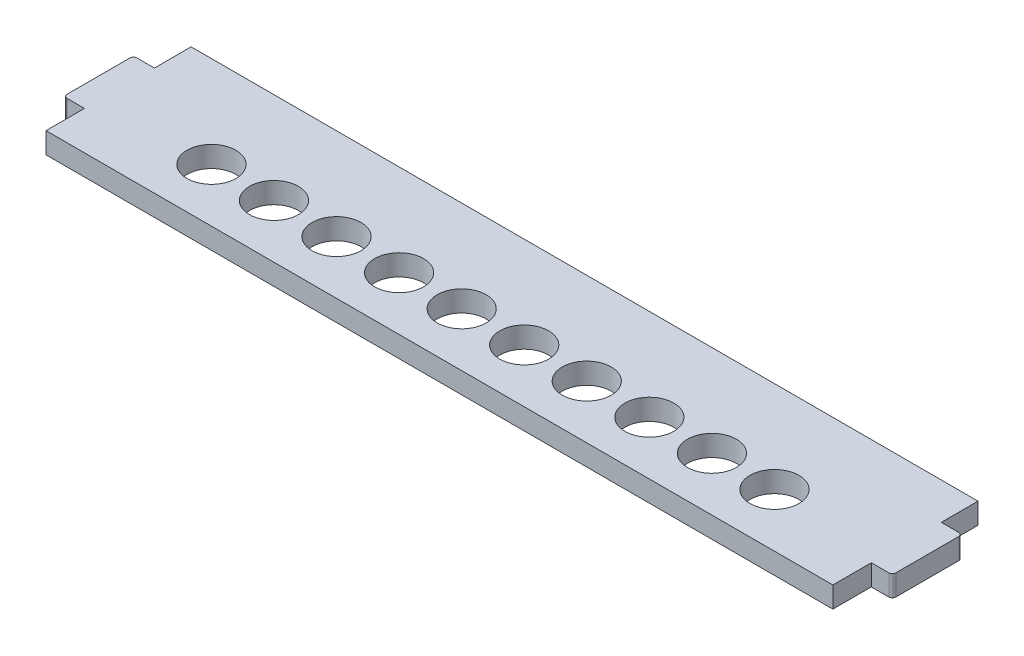
ISO-10303-21;
HEADER;
FILE_DESCRIPTION(('STEP AP214'),'2;1');
FILE_NAME('part.step','',(''),(''),'','','');
FILE_SCHEMA(('AUTOMOTIVE_DESIGN { 1 0 10303 214 1 1 1 1 }'));
ENDSEC;
DATA;
#1=APPLICATION_CONTEXT('core data for automotive mechanical design processes');
#2=APPLICATION_PROTOCOL_DEFINITION('international standard','automotive_design',2000,#1);
#3=PRODUCT_CONTEXT('',#1,'mechanical');
#4=PRODUCT('Part','Part','',(#3));
#5=PRODUCT_RELATED_PRODUCT_CATEGORY('part','',(#4));
#6=PRODUCT_DEFINITION_FORMATION('','',#4);
#7=PRODUCT_DEFINITION_CONTEXT('part definition',#1,'design');
#8=PRODUCT_DEFINITION('design','',#6,#7);
#9=PRODUCT_DEFINITION_SHAPE('','',#8);
#10=(LENGTH_UNIT() NAMED_UNIT(*) SI_UNIT(.MILLI.,.METRE.));
#11=(NAMED_UNIT(*) PLANE_ANGLE_UNIT() SI_UNIT($,.RADIAN.));
#12=(NAMED_UNIT(*) SI_UNIT($,.STERADIAN.) SOLID_ANGLE_UNIT());
#13=UNCERTAINTY_MEASURE_WITH_UNIT(LENGTH_MEASURE(1.E-05),#10,'distance_accuracy_value','');
#14=(GEOMETRIC_REPRESENTATION_CONTEXT(3) GLOBAL_UNCERTAINTY_ASSIGNED_CONTEXT((#13)) GLOBAL_UNIT_ASSIGNED_CONTEXT((#10,
#11,#12)) REPRESENTATION_CONTEXT('',''));
#15=CARTESIAN_POINT('',(0.,0.,0.));
#16=DIRECTION('',(0.,0.,1.));
#17=DIRECTION('',(1.,0.,0.));
#18=AXIS2_PLACEMENT_3D('',#15,#16,#17);
#19=CARTESIAN_POINT('',(-56.25,3.,0.));
#20=DIRECTION('',(-1.,0.,0.));
#21=DIRECTION('',(0.,0.,1.));
#22=AXIS2_PLACEMENT_3D('',#19,#20,#21);
#23=PLANE('',#22);
#24=DIRECTION('',(0.,0.,-1.));
#25=VECTOR('',#24,1.);
#26=CARTESIAN_POINT('',(-56.25,0.,0.));
#27=LINE('',#26,#25);
#28=CARTESIAN_POINT('',(-56.25,0.,20.75));
#29=VERTEX_POINT('',#28);
#30=CARTESIAN_POINT('',(-56.25,0.,15.25));
#31=VERTEX_POINT('',#30);
#32=EDGE_CURVE('E163',#29,#31,#27,.T.);
#33=ORIENTED_EDGE('',*,*,#32,.F.);
#34=DIRECTION('',(0.,-1.,0.));
#35=VECTOR('',#34,1.);
#36=CARTESIAN_POINT('',(-56.25,3.,20.75));
#37=LINE('',#36,#35);
#38=CARTESIAN_POINT('',(-56.25,3.,20.75));
#39=VERTEX_POINT('',#38);
#40=EDGE_CURVE('E158',#39,#29,#37,.T.);
#41=ORIENTED_EDGE('',*,*,#40,.F.);
#42=DIRECTION('',(0.,0.,-1.));
#43=VECTOR('',#42,1.);
#44=CARTESIAN_POINT('',(-56.25,3.,0.));
#45=LINE('',#44,#43);
#46=CARTESIAN_POINT('',(-56.25,3.,15.25));
#47=VERTEX_POINT('',#46);
#48=EDGE_CURVE('E161',#39,#47,#45,.T.);
#49=ORIENTED_EDGE('',*,*,#48,.T.);
#50=DIRECTION('',(0.,-1.,0.));
#51=VECTOR('',#50,1.);
#52=CARTESIAN_POINT('',(-56.25,3.,15.25));
#53=LINE('',#52,#51);
#54=EDGE_CURVE('E224',#47,#31,#53,.T.);
#55=ORIENTED_EDGE('',*,*,#54,.T.);
#56=EDGE_LOOP('',(#33,#41,#49,#55));
#57=FACE_BOUND('',#56,.T.);
#58=ADVANCED_FACE('F43',(#57),#23,.T.);
#59=CARTESIAN_POINT('',(0.,3.,20.75));
#60=DIRECTION('',(0.,0.,-1.));
#61=DIRECTION('',(-1.,0.,0.));
#62=AXIS2_PLACEMENT_3D('',#59,#60,#61);
#63=PLANE('',#62);
#64=DIRECTION('',(1.,0.,0.));
#65=VECTOR('',#64,1.);
#66=CARTESIAN_POINT('',(0.,0.,20.75));
#67=LINE('',#66,#65);
#68=CARTESIAN_POINT('',(56.25,0.,20.75));
#69=VERTEX_POINT('',#68);
#70=EDGE_CURVE('E267',#29,#69,#67,.T.);
#71=ORIENTED_EDGE('',*,*,#70,.T.);
#72=DIRECTION('',(0.,-1.,0.));
#73=VECTOR('',#72,1.);
#74=CARTESIAN_POINT('',(56.25,3.,20.75));
#75=LINE('',#74,#73);
#76=CARTESIAN_POINT('',(56.25,3.,20.75));
#77=VERTEX_POINT('',#76);
#78=EDGE_CURVE('E169',#77,#69,#75,.T.);
#79=ORIENTED_EDGE('',*,*,#78,.F.);
#80=DIRECTION('',(1.,0.,0.));
#81=VECTOR('',#80,1.);
#82=CARTESIAN_POINT('',(0.,3.,20.75));
#83=LINE('',#82,#81);
#84=EDGE_CURVE('E173',#39,#77,#83,.T.);
#85=ORIENTED_EDGE('',*,*,#84,.F.);
#86=ORIENTED_EDGE('',*,*,#40,.T.);
#87=EDGE_LOOP('',(#71,#79,#85,#86));
#88=FACE_BOUND('',#87,.T.);
#89=ADVANCED_FACE('F174',(#88),#63,.F.);
#90=CARTESIAN_POINT('',(56.25,3.,0.));
#91=DIRECTION('',(-1.,0.,0.));
#92=DIRECTION('',(0.,0.,1.));
#93=AXIS2_PLACEMENT_3D('',#90,#91,#92);
#94=PLANE('',#93);
#95=DIRECTION('',(0.,0.,-1.));
#96=VECTOR('',#95,1.);
#97=CARTESIAN_POINT('',(56.25,0.,0.));
#98=LINE('',#97,#96);
#99=CARTESIAN_POINT('',(56.25,0.,15.25));
#100=VERTEX_POINT('',#99);
#101=EDGE_CURVE('E270',#69,#100,#98,.T.);
#102=ORIENTED_EDGE('',*,*,#101,.T.);
#103=DIRECTION('',(0.,-1.,0.));
#104=VECTOR('',#103,1.);
#105=CARTESIAN_POINT('',(56.25,3.,15.25));
#106=LINE('',#105,#104);
#107=CARTESIAN_POINT('',(56.25,3.,15.25));
#108=VERTEX_POINT('',#107);
#109=EDGE_CURVE('E326',#108,#100,#106,.T.);
#110=ORIENTED_EDGE('',*,*,#109,.F.);
#111=DIRECTION('',(0.,0.,-1.));
#112=VECTOR('',#111,1.);
#113=CARTESIAN_POINT('',(56.25,3.,0.));
#114=LINE('',#113,#112);
#115=EDGE_CURVE('E178',#77,#108,#114,.T.);
#116=ORIENTED_EDGE('',*,*,#115,.F.);
#117=ORIENTED_EDGE('',*,*,#78,.T.);
#118=EDGE_LOOP('',(#102,#110,#116,#117));
#119=FACE_BOUND('',#118,.T.);
#120=ADVANCED_FACE('F424',(#119),#94,.F.);
#121=CARTESIAN_POINT('',(0.,3.,15.25));
#122=DIRECTION('',(0.,0.,-1.));
#123=DIRECTION('',(-1.,0.,0.));
#124=AXIS2_PLACEMENT_3D('',#121,#122,#123);
#125=PLANE('',#124);
#126=DIRECTION('',(1.,0.,0.));
#127=VECTOR('',#126,1.);
#128=CARTESIAN_POINT('',(0.,0.,15.25));
#129=LINE('',#128,#127);
#130=CARTESIAN_POINT('',(58.75,0.,15.25));
#131=VERTEX_POINT('',#130);
#132=EDGE_CURVE('E274',#100,#131,#129,.T.);
#133=ORIENTED_EDGE('',*,*,#132,.T.);
#134=DIRECTION('',(0.,-1.,0.));
#135=VECTOR('',#134,1.);
#136=CARTESIAN_POINT('',(58.75,3.,15.25));
#137=LINE('',#136,#135);
#138=CARTESIAN_POINT('',(58.75,3.,15.25));
#139=VERTEX_POINT('',#138);
#140=EDGE_CURVE('E11',#131,#139,#137,.F.);
#141=ORIENTED_EDGE('',*,*,#140,.T.);
#142=DIRECTION('',(1.,0.,0.));
#143=VECTOR('',#142,1.);
#144=CARTESIAN_POINT('',(0.,3.,15.25));
#145=LINE('',#144,#143);
#146=EDGE_CURVE('E194',#108,#139,#145,.T.);
#147=ORIENTED_EDGE('',*,*,#146,.F.);
#148=ORIENTED_EDGE('',*,*,#109,.T.);
#149=EDGE_LOOP('',(#133,#141,#147,#148));
#150=FACE_BOUND('',#149,.T.);
#151=ADVANCED_FACE('F428',(#150),#125,.F.);
#152=CARTESIAN_POINT('',(59.25,3.,0.));
#153=DIRECTION('',(-1.,0.,0.));
#154=DIRECTION('',(0.,0.,1.));
#155=AXIS2_PLACEMENT_3D('',#152,#153,#154);
#156=PLANE('',#155);
#157=DIRECTION('',(0.,0.,-1.));
#158=VECTOR('',#157,1.);
#159=CARTESIAN_POINT('',(59.25,0.,0.));
#160=LINE('',#159,#158);
#161=CARTESIAN_POINT('',(59.25,0.,14.75));
#162=VERTEX_POINT('',#161);
#163=CARTESIAN_POINT('',(59.25,0.,5.75));
#164=VERTEX_POINT('',#163);
#165=EDGE_CURVE('E278',#162,#164,#160,.T.);
#166=ORIENTED_EDGE('',*,*,#165,.T.);
#167=DIRECTION('',(0.,-1.,0.));
#168=VECTOR('',#167,1.);
#169=CARTESIAN_POINT('',(59.25,3.,5.75));
#170=LINE('',#169,#168);
#171=CARTESIAN_POINT('',(59.25,3.,5.75));
#172=VERTEX_POINT('',#171);
#173=EDGE_CURVE('E52',#164,#172,#170,.F.);
#174=ORIENTED_EDGE('',*,*,#173,.T.);
#175=DIRECTION('',(0.,0.,-1.));
#176=VECTOR('',#175,1.);
#177=CARTESIAN_POINT('',(59.25,3.,0.));
#178=LINE('',#177,#176);
#179=CARTESIAN_POINT('',(59.25,3.,14.75));
#180=VERTEX_POINT('',#179);
#181=EDGE_CURVE('E198',#180,#172,#178,.T.);
#182=ORIENTED_EDGE('',*,*,#181,.F.);
#183=DIRECTION('',(0.,-1.,0.));
#184=VECTOR('',#183,1.);
#185=CARTESIAN_POINT('',(59.25,3.,14.75));
#186=LINE('',#185,#184);
#187=EDGE_CURVE('E371',#180,#162,#186,.T.);
#188=ORIENTED_EDGE('',*,*,#187,.T.);
#189=EDGE_LOOP('',(#166,#174,#182,#188));
#190=FACE_BOUND('',#189,.T.);
#191=ADVANCED_FACE('F378',(#190),#156,.F.);
#192=CARTESIAN_POINT('',(0.,3.,5.24999999999998));
#193=DIRECTION('',(0.,0.,1.));
#194=DIRECTION('',(1.,0.,0.));
#195=AXIS2_PLACEMENT_3D('',#192,#193,#194);
#196=PLANE('',#195);
#197=DIRECTION('',(-1.,0.,0.));
#198=VECTOR('',#197,1.);
#199=CARTESIAN_POINT('',(0.,3.,5.24999999999998));
#200=LINE('',#199,#198);
#201=CARTESIAN_POINT('',(58.75,3.,5.25));
#202=VERTEX_POINT('',#201);
#203=CARTESIAN_POINT('',(56.25,3.,5.25));
#204=VERTEX_POINT('',#203);
#205=EDGE_CURVE('E201',#202,#204,#200,.T.);
#206=ORIENTED_EDGE('',*,*,#205,.F.);
#207=DIRECTION('',(0.,-1.,0.));
#208=VECTOR('',#207,1.);
#209=CARTESIAN_POINT('',(58.75,3.,5.25));
#210=LINE('',#209,#208);
#211=CARTESIAN_POINT('',(58.75,0.,5.25));
#212=VERTEX_POINT('',#211);
#213=EDGE_CURVE('E367',#202,#212,#210,.T.);
#214=ORIENTED_EDGE('',*,*,#213,.T.);
#215=DIRECTION('',(-1.,0.,0.));
#216=VECTOR('',#215,1.);
#217=CARTESIAN_POINT('',(0.,0.,5.24999999999998));
#218=LINE('',#217,#216);
#219=CARTESIAN_POINT('',(56.25,0.,5.25));
#220=VERTEX_POINT('',#219);
#221=EDGE_CURVE('E282',#212,#220,#218,.T.);
#222=ORIENTED_EDGE('',*,*,#221,.T.);
#223=DIRECTION('',(0.,-1.,0.));
#224=VECTOR('',#223,1.);
#225=CARTESIAN_POINT('',(56.25,3.,5.25));
#226=LINE('',#225,#224);
#227=EDGE_CURVE('E322',#204,#220,#226,.T.);
#228=ORIENTED_EDGE('',*,*,#227,.F.);
#229=EDGE_LOOP('',(#206,#214,#222,#228));
#230=FACE_BOUND('',#229,.T.);
#231=ADVANCED_FACE('F387',(#230),#196,.F.);
#232=CARTESIAN_POINT('',(56.25,3.,0.));
#233=DIRECTION('',(-1.,0.,0.));
#234=DIRECTION('',(0.,0.,1.));
#235=AXIS2_PLACEMENT_3D('',#232,#233,#234);
#236=PLANE('',#235);
#237=DIRECTION('',(0.,0.,-1.));
#238=VECTOR('',#237,1.);
#239=CARTESIAN_POINT('',(56.25,0.,0.));
#240=LINE('',#239,#238);
#241=CARTESIAN_POINT('',(56.25,0.,0.));
#242=VERTEX_POINT('',#241);
#243=EDGE_CURVE('E285',#220,#242,#240,.T.);
#244=ORIENTED_EDGE('',*,*,#243,.T.);
#245=DIRECTION('',(0.,-1.,0.));
#246=VECTOR('',#245,1.);
#247=CARTESIAN_POINT('',(56.25,3.,0.));
#248=LINE('',#247,#246);
#249=CARTESIAN_POINT('',(56.25,3.,0.));
#250=VERTEX_POINT('',#249);
#251=EDGE_CURVE('E318',#250,#242,#248,.T.);
#252=ORIENTED_EDGE('',*,*,#251,.F.);
#253=DIRECTION('',(0.,0.,-1.));
#254=VECTOR('',#253,1.);
#255=CARTESIAN_POINT('',(56.25,3.,0.));
#256=LINE('',#255,#254);
#257=EDGE_CURVE('E204',#204,#250,#256,.T.);
#258=ORIENTED_EDGE('',*,*,#257,.F.);
#259=ORIENTED_EDGE('',*,*,#227,.T.);
#260=EDGE_LOOP('',(#244,#252,#258,#259));
#261=FACE_BOUND('',#260,.T.);
#262=ADVANCED_FACE('F395',(#261),#236,.F.);
#263=CARTESIAN_POINT('',(0.,3.,0.));
#264=DIRECTION('',(0.,0.,1.));
#265=DIRECTION('',(1.,0.,0.));
#266=AXIS2_PLACEMENT_3D('',#263,#264,#265);
#267=PLANE('',#266);
#268=DIRECTION('',(-1.,0.,0.));
#269=VECTOR('',#268,1.);
#270=CARTESIAN_POINT('',(0.,0.,0.));
#271=LINE('',#270,#269);
#272=CARTESIAN_POINT('',(-56.25,0.,0.));
#273=VERTEX_POINT('',#272);
#274=EDGE_CURVE('E289',#242,#273,#271,.T.);
#275=ORIENTED_EDGE('',*,*,#274,.T.);
#276=DIRECTION('',(0.,-1.,0.));
#277=VECTOR('',#276,1.);
#278=CARTESIAN_POINT('',(-56.25,3.,0.));
#279=LINE('',#278,#277);
#280=CARTESIAN_POINT('',(-56.25,3.,0.));
#281=VERTEX_POINT('',#280);
#282=EDGE_CURVE('E315',#281,#273,#279,.T.);
#283=ORIENTED_EDGE('',*,*,#282,.F.);
#284=DIRECTION('',(-1.,0.,0.));
#285=VECTOR('',#284,1.);
#286=CARTESIAN_POINT('',(0.,3.,0.));
#287=LINE('',#286,#285);
#288=EDGE_CURVE('E208',#250,#281,#287,.T.);
#289=ORIENTED_EDGE('',*,*,#288,.F.);
#290=ORIENTED_EDGE('',*,*,#251,.T.);
#291=EDGE_LOOP('',(#275,#283,#289,#290));
#292=FACE_BOUND('',#291,.T.);
#293=ADVANCED_FACE('F399',(#292),#267,.F.);
#294=CARTESIAN_POINT('',(-56.25,3.,0.));
#295=DIRECTION('',(-1.,0.,0.));
#296=DIRECTION('',(0.,0.,1.));
#297=AXIS2_PLACEMENT_3D('',#294,#295,#296);
#298=PLANE('',#297);
#299=DIRECTION('',(0.,0.,-1.));
#300=VECTOR('',#299,1.);
#301=CARTESIAN_POINT('',(-56.25,0.,0.));
#302=LINE('',#301,#300);
#303=CARTESIAN_POINT('',(-56.25,0.,5.25));
#304=VERTEX_POINT('',#303);
#305=EDGE_CURVE('E293',#304,#273,#302,.T.);
#306=ORIENTED_EDGE('',*,*,#305,.F.);
#307=DIRECTION('',(0.,-1.,0.));
#308=VECTOR('',#307,1.);
#309=CARTESIAN_POINT('',(-56.25,3.,5.25));
#310=LINE('',#309,#308);
#311=CARTESIAN_POINT('',(-56.25,3.,5.25));
#312=VERTEX_POINT('',#311);
#313=EDGE_CURVE('E311',#312,#304,#310,.T.);
#314=ORIENTED_EDGE('',*,*,#313,.F.);
#315=DIRECTION('',(0.,0.,-1.));
#316=VECTOR('',#315,1.);
#317=CARTESIAN_POINT('',(-56.25,3.,0.));
#318=LINE('',#317,#316);
#319=EDGE_CURVE('E211',#312,#281,#318,.T.);
#320=ORIENTED_EDGE('',*,*,#319,.T.);
#321=ORIENTED_EDGE('',*,*,#282,.T.);
#322=EDGE_LOOP('',(#306,#314,#320,#321));
#323=FACE_BOUND('',#322,.T.);
#324=ADVANCED_FACE('F403',(#323),#298,.T.);
#325=CARTESIAN_POINT('',(0.,3.,5.24999999999998));
#326=DIRECTION('',(0.,0.,-1.));
#327=DIRECTION('',(-1.,0.,0.));
#328=AXIS2_PLACEMENT_3D('',#325,#326,#327);
#329=PLANE('',#328);
#330=DIRECTION('',(1.,0.,0.));
#331=VECTOR('',#330,1.);
#332=CARTESIAN_POINT('',(0.,0.,5.24999999999998));
#333=LINE('',#332,#331);
#334=CARTESIAN_POINT('',(-58.75,0.,5.25));
#335=VERTEX_POINT('',#334);
#336=EDGE_CURVE('E297',#335,#304,#333,.T.);
#337=ORIENTED_EDGE('',*,*,#336,.F.);
#338=DIRECTION('',(0.,-1.,0.));
#339=VECTOR('',#338,1.);
#340=CARTESIAN_POINT('',(-58.75,3.,5.25));
#341=LINE('',#340,#339);
#342=CARTESIAN_POINT('',(-58.75,3.,5.25));
#343=VERTEX_POINT('',#342);
#344=EDGE_CURVE('E350',#335,#343,#341,.F.);
#345=ORIENTED_EDGE('',*,*,#344,.T.);
#346=DIRECTION('',(1.,0.,0.));
#347=VECTOR('',#346,1.);
#348=CARTESIAN_POINT('',(0.,3.,5.24999999999998));
#349=LINE('',#348,#347);
#350=EDGE_CURVE('E215',#343,#312,#349,.T.);
#351=ORIENTED_EDGE('',*,*,#350,.T.);
#352=ORIENTED_EDGE('',*,*,#313,.T.);
#353=EDGE_LOOP('',(#337,#345,#351,#352));
#354=FACE_BOUND('',#353,.T.);
#355=ADVANCED_FACE('F406',(#354),#329,.T.);
#356=CARTESIAN_POINT('',(-59.25,3.,0.));
#357=DIRECTION('',(-1.,0.,0.));
#358=DIRECTION('',(0.,0.,1.));
#359=AXIS2_PLACEMENT_3D('',#356,#357,#358);
#360=PLANE('',#359);
#361=DIRECTION('',(0.,0.,-1.));
#362=VECTOR('',#361,1.);
#363=CARTESIAN_POINT('',(-59.25,3.,0.));
#364=LINE('',#363,#362);
#365=CARTESIAN_POINT('',(-59.25,3.,14.75));
#366=VERTEX_POINT('',#365);
#367=CARTESIAN_POINT('',(-59.25,3.,5.75));
#368=VERTEX_POINT('',#367);
#369=EDGE_CURVE('E218',#366,#368,#364,.T.);
#370=ORIENTED_EDGE('',*,*,#369,.T.);
#371=DIRECTION('',(0.,-1.,0.));
#372=VECTOR('',#371,1.);
#373=CARTESIAN_POINT('',(-59.25,3.,5.75));
#374=LINE('',#373,#372);
#375=CARTESIAN_POINT('',(-59.25,0.,5.75));
#376=VERTEX_POINT('',#375);
#377=EDGE_CURVE('E334',#368,#376,#374,.T.);
#378=ORIENTED_EDGE('',*,*,#377,.T.);
#379=DIRECTION('',(0.,0.,-1.));
#380=VECTOR('',#379,1.);
#381=CARTESIAN_POINT('',(-59.25,0.,0.));
#382=LINE('',#381,#380);
#383=CARTESIAN_POINT('',(-59.25,0.,14.75));
#384=VERTEX_POINT('',#383);
#385=EDGE_CURVE('E300',#384,#376,#382,.T.);
#386=ORIENTED_EDGE('',*,*,#385,.F.);
#387=DIRECTION('',(0.,-1.,0.));
#388=VECTOR('',#387,1.);
#389=CARTESIAN_POINT('',(-59.25,3.,14.75));
#390=LINE('',#389,#388);
#391=EDGE_CURVE('E168',#384,#366,#390,.F.);
#392=ORIENTED_EDGE('',*,*,#391,.T.);
#393=EDGE_LOOP('',(#370,#378,#386,#392));
#394=FACE_BOUND('',#393,.T.);
#395=ADVANCED_FACE('F414',(#394),#360,.T.);
#396=CARTESIAN_POINT('',(-40.25,3.,13.1));
#397=DIRECTION('',(0.,-1.,0.));
#398=DIRECTION('',(0.,0.,-1.));
#399=AXIS2_PLACEMENT_3D('',#396,#397,#398);
#400=CYLINDRICAL_SURFACE('',#399,3.5);
#401=CARTESIAN_POINT('',(-40.25,3.,13.1));
#402=DIRECTION('',(0.,1.,0.));
#403=DIRECTION('',(0.,0.,1.));
#404=AXIS2_PLACEMENT_3D('',#401,#402,#403);
#405=CIRCLE('',#404,3.5);
#406=CARTESIAN_POINT('',(-40.25,3.,16.6));
#407=VERTEX_POINT('',#406);
#408=EDGE_CURVE('E184',#407,#407,#405,.T.);
#409=ORIENTED_EDGE('',*,*,#408,.T.);
#410=EDGE_LOOP('',(#409));
#411=FACE_BOUND('',#410,.T.);
#412=CARTESIAN_POINT('',(-40.25,0.,13.1));
#413=DIRECTION('',(0.,1.,0.));
#414=DIRECTION('',(0.,0.,1.));
#415=AXIS2_PLACEMENT_3D('',#412,#413,#414);
#416=CIRCLE('',#415,3.5);
#417=CARTESIAN_POINT('',(-40.25,0.,16.6));
#418=VERTEX_POINT('',#417);
#419=EDGE_CURVE('E261',#418,#418,#416,.T.);
#420=ORIENTED_EDGE('',*,*,#419,.F.);
#421=EDGE_LOOP('',(#420));
#422=FACE_BOUND('',#421,.T.);
#423=ADVANCED_FACE('F444',(#411,#422),#400,.F.);
#424=CARTESIAN_POINT('',(-31.3055555555556,3.,13.1));
#425=DIRECTION('',(0.,-1.,0.));
#426=DIRECTION('',(0.,0.,-1.));
#427=AXIS2_PLACEMENT_3D('',#424,#425,#426);
#428=CYLINDRICAL_SURFACE('',#427,3.5);
#429=CARTESIAN_POINT('',(-31.3055555555556,3.,13.1));
#430=DIRECTION('',(0.,1.,0.));
#431=DIRECTION('',(0.,0.,1.));
#432=AXIS2_PLACEMENT_3D('',#429,#430,#431);
#433=CIRCLE('',#432,3.5);
#434=CARTESIAN_POINT('',(-31.3055555555556,3.,16.6));
#435=VERTEX_POINT('',#434);
#436=EDGE_CURVE('E188',#435,#435,#433,.T.);
#437=ORIENTED_EDGE('',*,*,#436,.T.);
#438=EDGE_LOOP('',(#437));
#439=FACE_BOUND('',#438,.T.);
#440=CARTESIAN_POINT('',(-31.3055555555556,0.,13.1));
#441=DIRECTION('',(0.,1.,0.));
#442=DIRECTION('',(0.,0.,1.));
#443=AXIS2_PLACEMENT_3D('',#440,#441,#442);
#444=CIRCLE('',#443,3.5);
#445=CARTESIAN_POINT('',(-31.3055555555556,0.,16.6));
#446=VERTEX_POINT('',#445);
#447=EDGE_CURVE('E257',#446,#446,#444,.T.);
#448=ORIENTED_EDGE('',*,*,#447,.F.);
#449=EDGE_LOOP('',(#448));
#450=FACE_BOUND('',#449,.T.);
#451=ADVANCED_FACE('F447',(#439,#450),#428,.F.);
#452=CARTESIAN_POINT('',(-22.3611111111111,3.,13.1));
#453=DIRECTION('',(0.,-1.,0.));
#454=DIRECTION('',(0.,0.,-1.));
#455=AXIS2_PLACEMENT_3D('',#452,#453,#454);
#456=CYLINDRICAL_SURFACE('',#455,3.5);
#457=CARTESIAN_POINT('',(-22.3611111111111,3.,13.1));
#458=DIRECTION('',(0.,1.,0.));
#459=DIRECTION('',(0.,0.,1.));
#460=AXIS2_PLACEMENT_3D('',#457,#458,#459);
#461=CIRCLE('',#460,3.5);
#462=CARTESIAN_POINT('',(-22.3611111111111,3.,16.6));
#463=VERTEX_POINT('',#462);
#464=EDGE_CURVE('E709',#463,#463,#461,.T.);
#465=ORIENTED_EDGE('',*,*,#464,.T.);
#466=EDGE_LOOP('',(#465));
#467=FACE_BOUND('',#466,.T.);
#468=CARTESIAN_POINT('',(-22.3611111111111,0.,13.1));
#469=DIRECTION('',(0.,1.,0.));
#470=DIRECTION('',(0.,0.,1.));
#471=AXIS2_PLACEMENT_3D('',#468,#469,#470);
#472=CIRCLE('',#471,3.5);
#473=CARTESIAN_POINT('',(-22.3611111111111,0.,16.6));
#474=VERTEX_POINT('',#473);
#475=EDGE_CURVE('E253',#474,#474,#472,.T.);
#476=ORIENTED_EDGE('',*,*,#475,.F.);
#477=EDGE_LOOP('',(#476));
#478=FACE_BOUND('',#477,.T.);
#479=ADVANCED_FACE('F451',(#467,#478),#456,.F.);
#480=CARTESIAN_POINT('',(-13.4166666666667,3.,13.1));
#481=DIRECTION('',(0.,-1.,0.));
#482=DIRECTION('',(0.,0.,-1.));
#483=AXIS2_PLACEMENT_3D('',#480,#481,#482);
#484=CYLINDRICAL_SURFACE('',#483,3.5);
#485=CARTESIAN_POINT('',(-13.4166666666667,3.,13.1));
#486=DIRECTION('',(0.,1.,0.));
#487=DIRECTION('',(0.,0.,1.));
#488=AXIS2_PLACEMENT_3D('',#485,#486,#487);
#489=CIRCLE('',#488,3.5);
#490=CARTESIAN_POINT('',(-13.4166666666667,3.,16.6));
#491=VERTEX_POINT('',#490);
#492=EDGE_CURVE('E705',#491,#491,#489,.T.);
#493=ORIENTED_EDGE('',*,*,#492,.T.);
#494=EDGE_LOOP('',(#493));
#495=FACE_BOUND('',#494,.T.);
#496=CARTESIAN_POINT('',(-13.4166666666667,0.,13.1));
#497=DIRECTION('',(0.,1.,0.));
#498=DIRECTION('',(0.,0.,1.));
#499=AXIS2_PLACEMENT_3D('',#496,#497,#498);
#500=CIRCLE('',#499,3.5);
#501=CARTESIAN_POINT('',(-13.4166666666667,0.,16.6));
#502=VERTEX_POINT('',#501);
#503=EDGE_CURVE('E249',#502,#502,#500,.T.);
#504=ORIENTED_EDGE('',*,*,#503,.F.);
#505=EDGE_LOOP('',(#504));
#506=FACE_BOUND('',#505,.T.);
#507=ADVANCED_FACE('F455',(#495,#506),#484,.F.);
#508=CARTESIAN_POINT('',(-4.47222222222222,3.,13.1));
#509=DIRECTION('',(0.,-1.,0.));
#510=DIRECTION('',(0.,0.,-1.));
#511=AXIS2_PLACEMENT_3D('',#508,#509,#510);
#512=CYLINDRICAL_SURFACE('',#511,3.5);
#513=CARTESIAN_POINT('',(-4.47222222222222,3.,13.1));
#514=DIRECTION('',(0.,1.,0.));
#515=DIRECTION('',(0.,0.,1.));
#516=AXIS2_PLACEMENT_3D('',#513,#514,#515);
#517=CIRCLE('',#516,3.5);
#518=CARTESIAN_POINT('',(-4.47222222222222,3.,16.6));
#519=VERTEX_POINT('',#518);
#520=EDGE_CURVE('E701',#519,#519,#517,.T.);
#521=ORIENTED_EDGE('',*,*,#520,.T.);
#522=EDGE_LOOP('',(#521));
#523=FACE_BOUND('',#522,.T.);
#524=CARTESIAN_POINT('',(-4.47222222222222,0.,13.1));
#525=DIRECTION('',(0.,1.,0.));
#526=DIRECTION('',(0.,0.,1.));
#527=AXIS2_PLACEMENT_3D('',#524,#525,#526);
#528=CIRCLE('',#527,3.5);
#529=CARTESIAN_POINT('',(-4.47222222222222,0.,16.6));
#530=VERTEX_POINT('',#529);
#531=EDGE_CURVE('E245',#530,#530,#528,.T.);
#532=ORIENTED_EDGE('',*,*,#531,.F.);
#533=EDGE_LOOP('',(#532));
#534=FACE_BOUND('',#533,.T.);
#535=ADVANCED_FACE('F459',(#523,#534),#512,.F.);
#536=CARTESIAN_POINT('',(4.47222222222223,3.,13.1));
#537=DIRECTION('',(0.,-1.,0.));
#538=DIRECTION('',(0.,0.,-1.));
#539=AXIS2_PLACEMENT_3D('',#536,#537,#538);
#540=CYLINDRICAL_SURFACE('',#539,3.5);
#541=CARTESIAN_POINT('',(4.47222222222223,3.,13.1));
#542=DIRECTION('',(0.,1.,0.));
#543=DIRECTION('',(0.,0.,1.));
#544=AXIS2_PLACEMENT_3D('',#541,#542,#543);
#545=CIRCLE('',#544,3.5);
#546=CARTESIAN_POINT('',(4.47222222222223,3.,16.6));
#547=VERTEX_POINT('',#546);
#548=EDGE_CURVE('E697',#547,#547,#545,.T.);
#549=ORIENTED_EDGE('',*,*,#548,.T.);
#550=EDGE_LOOP('',(#549));
#551=FACE_BOUND('',#550,.T.);
#552=CARTESIAN_POINT('',(4.47222222222223,0.,13.1));
#553=DIRECTION('',(0.,1.,0.));
#554=DIRECTION('',(0.,0.,1.));
#555=AXIS2_PLACEMENT_3D('',#552,#553,#554);
#556=CIRCLE('',#555,3.5);
#557=CARTESIAN_POINT('',(4.47222222222223,0.,16.6));
#558=VERTEX_POINT('',#557);
#559=EDGE_CURVE('E241',#558,#558,#556,.T.);
#560=ORIENTED_EDGE('',*,*,#559,.F.);
#561=EDGE_LOOP('',(#560));
#562=FACE_BOUND('',#561,.T.);
#563=ADVANCED_FACE('F463',(#551,#562),#540,.F.);
#564=CARTESIAN_POINT('',(13.4166666666667,3.,13.1));
#565=DIRECTION('',(0.,-1.,0.));
#566=DIRECTION('',(0.,0.,-1.));
#567=AXIS2_PLACEMENT_3D('',#564,#565,#566);
#568=CYLINDRICAL_SURFACE('',#567,3.5);
#569=CARTESIAN_POINT('',(13.4166666666667,3.,13.1));
#570=DIRECTION('',(0.,1.,0.));
#571=DIRECTION('',(0.,0.,1.));
#572=AXIS2_PLACEMENT_3D('',#569,#570,#571);
#573=CIRCLE('',#572,3.5);
#574=CARTESIAN_POINT('',(13.4166666666667,3.,16.6));
#575=VERTEX_POINT('',#574);
#576=EDGE_CURVE('E693',#575,#575,#573,.T.);
#577=ORIENTED_EDGE('',*,*,#576,.T.);
#578=EDGE_LOOP('',(#577));
#579=FACE_BOUND('',#578,.T.);
#580=CARTESIAN_POINT('',(13.4166666666667,0.,13.1));
#581=DIRECTION('',(0.,1.,0.));
#582=DIRECTION('',(0.,0.,1.));
#583=AXIS2_PLACEMENT_3D('',#580,#581,#582);
#584=CIRCLE('',#583,3.5);
#585=CARTESIAN_POINT('',(13.4166666666667,0.,16.6));
#586=VERTEX_POINT('',#585);
#587=EDGE_CURVE('E237',#586,#586,#584,.T.);
#588=ORIENTED_EDGE('',*,*,#587,.F.);
#589=EDGE_LOOP('',(#588));
#590=FACE_BOUND('',#589,.T.);
#591=ADVANCED_FACE('F467',(#579,#590),#568,.F.);
#592=CARTESIAN_POINT('',(22.3611111111111,3.,13.1));
#593=DIRECTION('',(0.,-1.,0.));
#594=DIRECTION('',(0.,0.,-1.));
#595=AXIS2_PLACEMENT_3D('',#592,#593,#594);
#596=CYLINDRICAL_SURFACE('',#595,3.5);
#597=CARTESIAN_POINT('',(22.3611111111111,3.,13.1));
#598=DIRECTION('',(0.,1.,0.));
#599=DIRECTION('',(0.,0.,1.));
#600=AXIS2_PLACEMENT_3D('',#597,#598,#599);
#601=CIRCLE('',#600,3.5);
#602=CARTESIAN_POINT('',(22.3611111111111,3.,16.6));
#603=VERTEX_POINT('',#602);
#604=EDGE_CURVE('E689',#603,#603,#601,.T.);
#605=ORIENTED_EDGE('',*,*,#604,.T.);
#606=EDGE_LOOP('',(#605));
#607=FACE_BOUND('',#606,.T.);
#608=CARTESIAN_POINT('',(22.3611111111111,0.,13.1));
#609=DIRECTION('',(0.,1.,0.));
#610=DIRECTION('',(0.,0.,1.));
#611=AXIS2_PLACEMENT_3D('',#608,#609,#610);
#612=CIRCLE('',#611,3.5);
#613=CARTESIAN_POINT('',(22.3611111111111,0.,16.6));
#614=VERTEX_POINT('',#613);
#615=EDGE_CURVE('E233',#614,#614,#612,.T.);
#616=ORIENTED_EDGE('',*,*,#615,.F.);
#617=EDGE_LOOP('',(#616));
#618=FACE_BOUND('',#617,.T.);
#619=ADVANCED_FACE('F471',(#607,#618),#596,.F.);
#620=CARTESIAN_POINT('',(31.3055555555556,3.,13.1));
#621=DIRECTION('',(0.,-1.,0.));
#622=DIRECTION('',(0.,0.,-1.));
#623=AXIS2_PLACEMENT_3D('',#620,#621,#622);
#624=CYLINDRICAL_SURFACE('',#623,3.5);
#625=CARTESIAN_POINT('',(31.3055555555556,3.,13.1));
#626=DIRECTION('',(0.,1.,0.));
#627=DIRECTION('',(0.,0.,1.));
#628=AXIS2_PLACEMENT_3D('',#625,#626,#627);
#629=CIRCLE('',#628,3.5);
#630=CARTESIAN_POINT('',(31.3055555555556,3.,16.6));
#631=VERTEX_POINT('',#630);
#632=EDGE_CURVE('E685',#631,#631,#629,.T.);
#633=ORIENTED_EDGE('',*,*,#632,.T.);
#634=EDGE_LOOP('',(#633));
#635=FACE_BOUND('',#634,.T.);
#636=CARTESIAN_POINT('',(31.3055555555556,0.,13.1));
#637=DIRECTION('',(0.,1.,0.));
#638=DIRECTION('',(0.,0.,1.));
#639=AXIS2_PLACEMENT_3D('',#636,#637,#638);
#640=CIRCLE('',#639,3.5);
#641=CARTESIAN_POINT('',(31.3055555555556,0.,16.6));
#642=VERTEX_POINT('',#641);
#643=EDGE_CURVE('E229',#642,#642,#640,.T.);
#644=ORIENTED_EDGE('',*,*,#643,.F.);
#645=EDGE_LOOP('',(#644));
#646=FACE_BOUND('',#645,.T.);
#647=ADVANCED_FACE('F475',(#635,#646),#624,.F.);
#648=CARTESIAN_POINT('',(40.25,3.,13.1));
#649=DIRECTION('',(0.,-1.,0.));
#650=DIRECTION('',(0.,0.,-1.));
#651=AXIS2_PLACEMENT_3D('',#648,#649,#650);
#652=CYLINDRICAL_SURFACE('',#651,3.5);
#653=CARTESIAN_POINT('',(40.25,3.,13.1));
#654=DIRECTION('',(0.,1.,0.));
#655=DIRECTION('',(0.,0.,1.));
#656=AXIS2_PLACEMENT_3D('',#653,#654,#655);
#657=CIRCLE('',#656,3.5);
#658=CARTESIAN_POINT('',(40.25,3.,16.6));
#659=VERTEX_POINT('',#658);
#660=EDGE_CURVE('E308',#659,#659,#657,.T.);
#661=ORIENTED_EDGE('',*,*,#660,.T.);
#662=EDGE_LOOP('',(#661));
#663=FACE_BOUND('',#662,.T.);
#664=CARTESIAN_POINT('',(40.25,0.,13.1));
#665=DIRECTION('',(0.,1.,0.));
#666=DIRECTION('',(0.,0.,1.));
#667=AXIS2_PLACEMENT_3D('',#664,#665,#666);
#668=CIRCLE('',#667,3.5);
#669=CARTESIAN_POINT('',(40.25,0.,16.6));
#670=VERTEX_POINT('',#669);
#671=EDGE_CURVE('E225',#670,#670,#668,.T.);
#672=ORIENTED_EDGE('',*,*,#671,.F.);
#673=EDGE_LOOP('',(#672));
#674=FACE_BOUND('',#673,.T.);
#675=ADVANCED_FACE('F479',(#663,#674),#652,.F.);
#676=CARTESIAN_POINT('',(0.,3.,15.25));
#677=DIRECTION('',(0.,0.,1.));
#678=DIRECTION('',(1.,0.,0.));
#679=AXIS2_PLACEMENT_3D('',#676,#677,#678);
#680=PLANE('',#679);
#681=DIRECTION('',(-1.,0.,0.));
#682=VECTOR('',#681,1.);
#683=CARTESIAN_POINT('',(0.,3.,15.25));
#684=LINE('',#683,#682);
#685=CARTESIAN_POINT('',(-58.75,3.,15.25));
#686=VERTEX_POINT('',#685);
#687=EDGE_CURVE('E182',#47,#686,#684,.T.);
#688=ORIENTED_EDGE('',*,*,#687,.T.);
#689=DIRECTION('',(0.,-1.,0.));
#690=VECTOR('',#689,1.);
#691=CARTESIAN_POINT('',(-58.75,3.,15.25));
#692=LINE('',#691,#690);
#693=CARTESIAN_POINT('',(-58.75,0.,15.25));
#694=VERTEX_POINT('',#693);
#695=EDGE_CURVE('E363',#686,#694,#692,.T.);
#696=ORIENTED_EDGE('',*,*,#695,.T.);
#697=DIRECTION('',(-1.,0.,0.));
#698=VECTOR('',#697,1.);
#699=CARTESIAN_POINT('',(0.,0.,15.25));
#700=LINE('',#699,#698);
#701=EDGE_CURVE('E304',#31,#694,#700,.T.);
#702=ORIENTED_EDGE('',*,*,#701,.F.);
#703=ORIENTED_EDGE('',*,*,#54,.F.);
#704=EDGE_LOOP('',(#688,#696,#702,#703));
#705=FACE_BOUND('',#704,.T.);
#706=ADVANCED_FACE('F421',(#705),#680,.T.);
#707=CARTESIAN_POINT('',(0.,3.,0.));
#708=DIRECTION('',(0.,1.,0.));
#709=DIRECTION('',(0.,0.,1.));
#710=AXIS2_PLACEMENT_3D('',#707,#708,#709);
#711=PLANE('',#710);
#712=ORIENTED_EDGE('',*,*,#660,.F.);
#713=EDGE_LOOP('',(#712));
#714=FACE_BOUND('',#713,.T.);
#715=ORIENTED_EDGE('',*,*,#632,.F.);
#716=EDGE_LOOP('',(#715));
#717=FACE_BOUND('',#716,.T.);
#718=ORIENTED_EDGE('',*,*,#604,.F.);
#719=EDGE_LOOP('',(#718));
#720=FACE_BOUND('',#719,.T.);
#721=ORIENTED_EDGE('',*,*,#576,.F.);
#722=EDGE_LOOP('',(#721));
#723=FACE_BOUND('',#722,.T.);
#724=ORIENTED_EDGE('',*,*,#548,.F.);
#725=EDGE_LOOP('',(#724));
#726=FACE_BOUND('',#725,.T.);
#727=ORIENTED_EDGE('',*,*,#520,.F.);
#728=EDGE_LOOP('',(#727));
#729=FACE_BOUND('',#728,.T.);
#730=ORIENTED_EDGE('',*,*,#492,.F.);
#731=EDGE_LOOP('',(#730));
#732=FACE_BOUND('',#731,.T.);
#733=ORIENTED_EDGE('',*,*,#464,.F.);
#734=EDGE_LOOP('',(#733));
#735=FACE_BOUND('',#734,.T.);
#736=ORIENTED_EDGE('',*,*,#436,.F.);
#737=EDGE_LOOP('',(#736));
#738=FACE_BOUND('',#737,.T.);
#739=ORIENTED_EDGE('',*,*,#408,.F.);
#740=EDGE_LOOP('',(#739));
#741=FACE_BOUND('',#740,.T.);
#742=ORIENTED_EDGE('',*,*,#350,.F.);
#743=CARTESIAN_POINT('',(-58.75,3.,5.75));
#744=DIRECTION('',(0.,1.,0.));
#745=DIRECTION('',(0.,0.,1.));
#746=AXIS2_PLACEMENT_3D('',#743,#744,#745);
#747=CIRCLE('',#746,0.5);
#748=EDGE_CURVE('E360',#343,#368,#747,.T.);
#749=ORIENTED_EDGE('',*,*,#748,.T.);
#750=ORIENTED_EDGE('',*,*,#369,.F.);
#751=CARTESIAN_POINT('',(-58.75,3.,14.75));
#752=DIRECTION('',(0.,1.,0.));
#753=DIRECTION('',(0.,0.,1.));
#754=AXIS2_PLACEMENT_3D('',#751,#752,#753);
#755=CIRCLE('',#754,0.5);
#756=EDGE_CURVE('E59',#366,#686,#755,.T.);
#757=ORIENTED_EDGE('',*,*,#756,.T.);
#758=ORIENTED_EDGE('',*,*,#687,.F.);
#759=ORIENTED_EDGE('',*,*,#48,.F.);
#760=ORIENTED_EDGE('',*,*,#84,.T.);
#761=ORIENTED_EDGE('',*,*,#115,.T.);
#762=ORIENTED_EDGE('',*,*,#146,.T.);
#763=CARTESIAN_POINT('',(58.75,3.,14.75));
#764=DIRECTION('',(0.,1.,0.));
#765=DIRECTION('',(0.,0.,1.));
#766=AXIS2_PLACEMENT_3D('',#763,#764,#765);
#767=CIRCLE('',#766,0.5);
#768=EDGE_CURVE('E353',#139,#180,#767,.T.);
#769=ORIENTED_EDGE('',*,*,#768,.T.);
#770=ORIENTED_EDGE('',*,*,#181,.T.);
#771=CARTESIAN_POINT('',(58.75,3.,5.75));
#772=DIRECTION('',(0.,1.,0.));
#773=DIRECTION('',(0.,0.,1.));
#774=AXIS2_PLACEMENT_3D('',#771,#772,#773);
#775=CIRCLE('',#774,0.5);
#776=EDGE_CURVE('E66',#172,#202,#775,.T.);
#777=ORIENTED_EDGE('',*,*,#776,.T.);
#778=ORIENTED_EDGE('',*,*,#205,.T.);
#779=ORIENTED_EDGE('',*,*,#257,.T.);
#780=ORIENTED_EDGE('',*,*,#288,.T.);
#781=ORIENTED_EDGE('',*,*,#319,.F.);
#782=EDGE_LOOP('',(#742,#749,#750,#757,#758,#759,#760,#761,#762,#769,#770,#777,#778,#779,#780,#781));
#783=FACE_BOUND('',#782,.T.);
#784=ADVANCED_FACE('F181',(#714,#717,#720,#723,#726,#729,#732,#735,#738,#741,#783),#711,.T.);
#785=CARTESIAN_POINT('',(0.,0.,0.));
#786=DIRECTION('',(0.,1.,0.));
#787=DIRECTION('',(0.,0.,1.));
#788=AXIS2_PLACEMENT_3D('',#785,#786,#787);
#789=PLANE('',#788);
#790=ORIENTED_EDGE('',*,*,#671,.T.);
#791=EDGE_LOOP('',(#790));
#792=FACE_BOUND('',#791,.T.);
#793=ORIENTED_EDGE('',*,*,#643,.T.);
#794=EDGE_LOOP('',(#793));
#795=FACE_BOUND('',#794,.T.);
#796=ORIENTED_EDGE('',*,*,#615,.T.);
#797=EDGE_LOOP('',(#796));
#798=FACE_BOUND('',#797,.T.);
#799=ORIENTED_EDGE('',*,*,#587,.T.);
#800=EDGE_LOOP('',(#799));
#801=FACE_BOUND('',#800,.T.);
#802=ORIENTED_EDGE('',*,*,#559,.T.);
#803=EDGE_LOOP('',(#802));
#804=FACE_BOUND('',#803,.T.);
#805=ORIENTED_EDGE('',*,*,#531,.T.);
#806=EDGE_LOOP('',(#805));
#807=FACE_BOUND('',#806,.T.);
#808=ORIENTED_EDGE('',*,*,#503,.T.);
#809=EDGE_LOOP('',(#808));
#810=FACE_BOUND('',#809,.T.);
#811=ORIENTED_EDGE('',*,*,#475,.T.);
#812=EDGE_LOOP('',(#811));
#813=FACE_BOUND('',#812,.T.);
#814=ORIENTED_EDGE('',*,*,#447,.T.);
#815=EDGE_LOOP('',(#814));
#816=FACE_BOUND('',#815,.T.);
#817=ORIENTED_EDGE('',*,*,#419,.T.);
#818=EDGE_LOOP('',(#817));
#819=FACE_BOUND('',#818,.T.);
#820=ORIENTED_EDGE('',*,*,#385,.T.);
#821=CARTESIAN_POINT('',(-58.75,0.,5.75));
#822=DIRECTION('',(0.,1.,0.));
#823=DIRECTION('',(0.,0.,1.));
#824=AXIS2_PLACEMENT_3D('',#821,#822,#823);
#825=CIRCLE('',#824,0.5);
#826=EDGE_CURVE('E347',#376,#335,#825,.F.);
#827=ORIENTED_EDGE('',*,*,#826,.T.);
#828=ORIENTED_EDGE('',*,*,#336,.T.);
#829=ORIENTED_EDGE('',*,*,#305,.T.);
#830=ORIENTED_EDGE('',*,*,#274,.F.);
#831=ORIENTED_EDGE('',*,*,#243,.F.);
#832=ORIENTED_EDGE('',*,*,#221,.F.);
#833=CARTESIAN_POINT('',(58.75,0.,5.75));
#834=DIRECTION('',(0.,1.,0.));
#835=DIRECTION('',(0.,0.,1.));
#836=AXIS2_PLACEMENT_3D('',#833,#834,#835);
#837=CIRCLE('',#836,0.5);
#838=EDGE_CURVE('E341',#212,#164,#837,.F.);
#839=ORIENTED_EDGE('',*,*,#838,.T.);
#840=ORIENTED_EDGE('',*,*,#165,.F.);
#841=CARTESIAN_POINT('',(58.75,0.,14.75));
#842=DIRECTION('',(0.,1.,0.));
#843=DIRECTION('',(0.,0.,1.));
#844=AXIS2_PLACEMENT_3D('',#841,#842,#843);
#845=CIRCLE('',#844,0.5);
#846=EDGE_CURVE('E338',#162,#131,#845,.F.);
#847=ORIENTED_EDGE('',*,*,#846,.T.);
#848=ORIENTED_EDGE('',*,*,#132,.F.);
#849=ORIENTED_EDGE('',*,*,#101,.F.);
#850=ORIENTED_EDGE('',*,*,#70,.F.);
#851=ORIENTED_EDGE('',*,*,#32,.T.);
#852=ORIENTED_EDGE('',*,*,#701,.T.);
#853=CARTESIAN_POINT('',(-58.75,0.,14.75));
#854=DIRECTION('',(0.,1.,0.));
#855=DIRECTION('',(0.,0.,1.));
#856=AXIS2_PLACEMENT_3D('',#853,#854,#855);
#857=CIRCLE('',#856,0.5);
#858=EDGE_CURVE('E344',#694,#384,#857,.F.);
#859=ORIENTED_EDGE('',*,*,#858,.T.);
#860=EDGE_LOOP('',(#820,#827,#828,#829,#830,#831,#832,#839,#840,#847,#848,#849,#850,#851,#852,#859));
#861=FACE_BOUND('',#860,.T.);
#862=ADVANCED_FACE('F391',(#792,#795,#798,#801,#804,#807,#810,#813,#816,#819,#861),#789,.F.);
#863=CARTESIAN_POINT('',(-58.75,3.,5.75));
#864=DIRECTION('',(0.,-1.,0.));
#865=DIRECTION('',(0.,0.,-1.));
#866=AXIS2_PLACEMENT_3D('',#863,#864,#865);
#867=CYLINDRICAL_SURFACE('',#866,0.5);
#868=ORIENTED_EDGE('',*,*,#748,.F.);
#869=ORIENTED_EDGE('',*,*,#344,.F.);
#870=ORIENTED_EDGE('',*,*,#826,.F.);
#871=ORIENTED_EDGE('',*,*,#377,.F.);
#872=EDGE_LOOP('',(#868,#869,#870,#871));
#873=FACE_BOUND('',#872,.T.);
#874=ADVANCED_FACE('F411',(#873),#867,.T.);
#875=CARTESIAN_POINT('',(-58.75,3.,14.75));
#876=DIRECTION('',(0.,-1.,0.));
#877=DIRECTION('',(0.,0.,-1.));
#878=AXIS2_PLACEMENT_3D('',#875,#876,#877);
#879=CYLINDRICAL_SURFACE('',#878,0.5);
#880=ORIENTED_EDGE('',*,*,#756,.F.);
#881=ORIENTED_EDGE('',*,*,#391,.F.);
#882=ORIENTED_EDGE('',*,*,#858,.F.);
#883=ORIENTED_EDGE('',*,*,#695,.F.);
#884=EDGE_LOOP('',(#880,#881,#882,#883));
#885=FACE_BOUND('',#884,.T.);
#886=ADVANCED_FACE('F419',(#885),#879,.T.);
#887=CARTESIAN_POINT('',(58.75,3.,5.75));
#888=DIRECTION('',(0.,-1.,0.));
#889=DIRECTION('',(0.,0.,-1.));
#890=AXIS2_PLACEMENT_3D('',#887,#888,#889);
#891=CYLINDRICAL_SURFACE('',#890,0.5);
#892=ORIENTED_EDGE('',*,*,#776,.F.);
#893=ORIENTED_EDGE('',*,*,#173,.F.);
#894=ORIENTED_EDGE('',*,*,#838,.F.);
#895=ORIENTED_EDGE('',*,*,#213,.F.);
#896=EDGE_LOOP('',(#892,#893,#894,#895));
#897=FACE_BOUND('',#896,.T.);
#898=ADVANCED_FACE('F384',(#897),#891,.T.);
#899=CARTESIAN_POINT('',(58.75,3.,14.75));
#900=DIRECTION('',(0.,-1.,0.));
#901=DIRECTION('',(0.,0.,-1.));
#902=AXIS2_PLACEMENT_3D('',#899,#900,#901);
#903=CYLINDRICAL_SURFACE('',#902,0.5);
#904=ORIENTED_EDGE('',*,*,#768,.F.);
#905=ORIENTED_EDGE('',*,*,#140,.F.);
#906=ORIENTED_EDGE('',*,*,#846,.F.);
#907=ORIENTED_EDGE('',*,*,#187,.F.);
#908=EDGE_LOOP('',(#904,#905,#906,#907));
#909=FACE_BOUND('',#908,.T.);
#910=ADVANCED_FACE('F45',(#909),#903,.T.);
#911=CLOSED_SHELL('',(#58,#89,#120,#151,#191,#231,#262,#293,#324,#355,#395,#423,#451,#479,#507,
#535,#563,#591,#619,#647,#675,#706,#784,#862,#874,#886,#898,#910));
#912=MANIFOLD_SOLID_BREP('B2',#911);
#913=ADVANCED_BREP_SHAPE_REPRESENTATION('',(#18,#912),#14);
#914=SHAPE_DEFINITION_REPRESENTATION(#9,#913);
ENDSEC;
END-ISO-10303-21;
